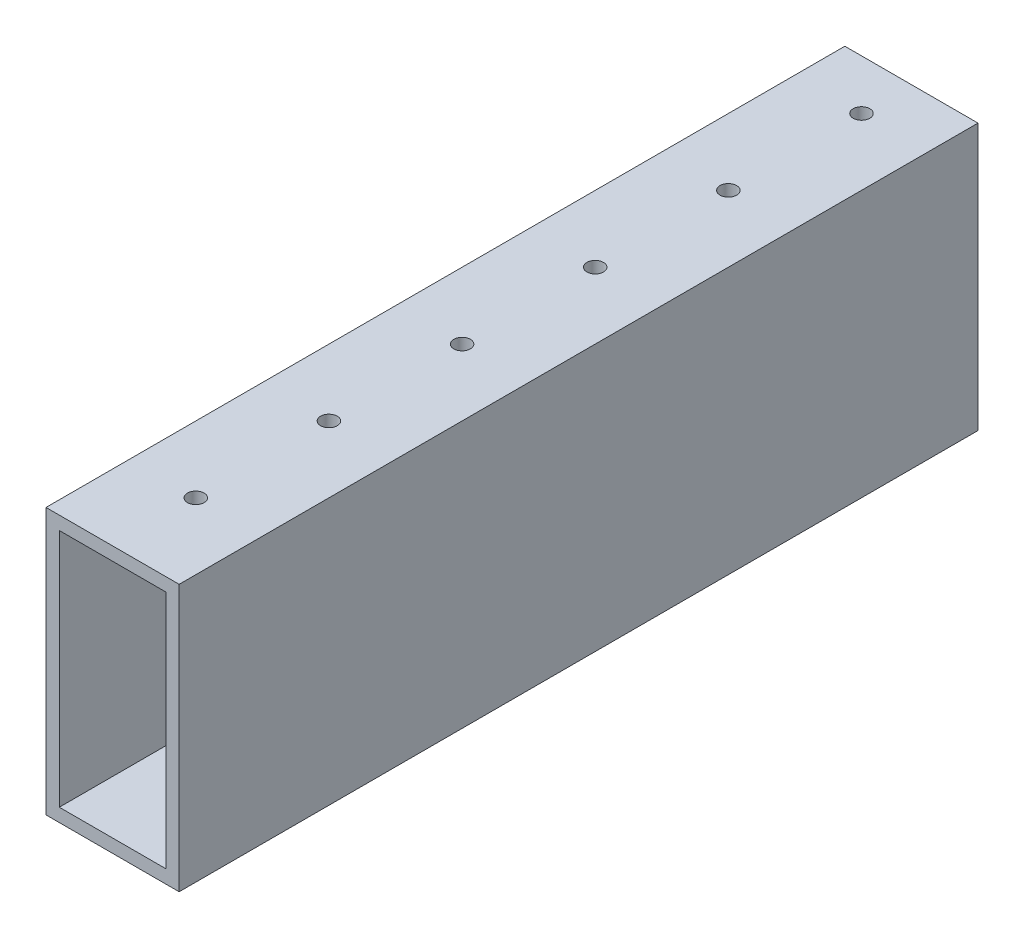
ISO-10303-21;
HEADER;
FILE_DESCRIPTION(('STEP AP214'),'2;1');
FILE_NAME('part.step','',(''),(''),'','','');
FILE_SCHEMA(('AUTOMOTIVE_DESIGN { 1 0 10303 214 1 1 1 1 }'));
ENDSEC;
DATA;
#1=APPLICATION_CONTEXT('core data for automotive mechanical design processes');
#2=APPLICATION_PROTOCOL_DEFINITION('international standard','automotive_design',2000,#1);
#3=PRODUCT_CONTEXT('',#1,'mechanical');
#4=PRODUCT('Part','Part','',(#3));
#5=PRODUCT_RELATED_PRODUCT_CATEGORY('part','',(#4));
#6=PRODUCT_DEFINITION_FORMATION('','',#4);
#7=PRODUCT_DEFINITION_CONTEXT('part definition',#1,'design');
#8=PRODUCT_DEFINITION('design','',#6,#7);
#9=PRODUCT_DEFINITION_SHAPE('','',#8);
#10=(LENGTH_UNIT() NAMED_UNIT(*) SI_UNIT(.MILLI.,.METRE.));
#11=(NAMED_UNIT(*) PLANE_ANGLE_UNIT() SI_UNIT($,.RADIAN.));
#12=(NAMED_UNIT(*) SI_UNIT($,.STERADIAN.) SOLID_ANGLE_UNIT());
#13=UNCERTAINTY_MEASURE_WITH_UNIT(LENGTH_MEASURE(1.E-05),#10,'distance_accuracy_value','');
#14=(GEOMETRIC_REPRESENTATION_CONTEXT(3) GLOBAL_UNCERTAINTY_ASSIGNED_CONTEXT((#13)) GLOBAL_UNIT_ASSIGNED_CONTEXT((#10,
#11,#12)) REPRESENTATION_CONTEXT('',''));
#15=CARTESIAN_POINT('',(0.,0.,0.));
#16=DIRECTION('',(0.,0.,1.));
#17=DIRECTION('',(1.,0.,0.));
#18=AXIS2_PLACEMENT_3D('',#15,#16,#17);
#19=CARTESIAN_POINT('',(0.,0.,152.4));
#20=DIRECTION('',(0.,0.,1.));
#21=DIRECTION('',(1.,0.,0.));
#22=AXIS2_PLACEMENT_3D('',#19,#20,#21);
#23=PLANE('',#22);
#24=DIRECTION('',(0.,-1.,0.));
#25=VECTOR('',#24,1.);
#26=CARTESIAN_POINT('',(0.,0.,152.4));
#27=LINE('',#26,#25);
#28=CARTESIAN_POINT('',(0.,50.8,152.4));
#29=VERTEX_POINT('',#28);
#30=CARTESIAN_POINT('',(0.,0.,152.4));
#31=VERTEX_POINT('',#30);
#32=EDGE_CURVE('E163',#29,#31,#27,.T.);
#33=ORIENTED_EDGE('',*,*,#32,.T.);
#34=DIRECTION('',(1.,0.,0.));
#35=VECTOR('',#34,1.);
#36=CARTESIAN_POINT('',(0.,0.,152.4));
#37=LINE('',#36,#35);
#38=CARTESIAN_POINT('',(25.4,0.,152.4));
#39=VERTEX_POINT('',#38);
#40=EDGE_CURVE('E166',#31,#39,#37,.T.);
#41=ORIENTED_EDGE('',*,*,#40,.T.);
#42=DIRECTION('',(0.,1.,0.));
#43=VECTOR('',#42,1.);
#44=CARTESIAN_POINT('',(25.4,0.,152.4));
#45=LINE('',#44,#43);
#46=CARTESIAN_POINT('',(25.4,50.8,152.4));
#47=VERTEX_POINT('',#46);
#48=EDGE_CURVE('E169',#39,#47,#45,.T.);
#49=ORIENTED_EDGE('',*,*,#48,.T.);
#50=DIRECTION('',(-1.,0.,0.));
#51=VECTOR('',#50,1.);
#52=CARTESIAN_POINT('',(0.,50.8,152.4));
#53=LINE('',#52,#51);
#54=EDGE_CURVE('E171',#47,#29,#53,.T.);
#55=ORIENTED_EDGE('',*,*,#54,.T.);
#56=EDGE_LOOP('',(#33,#41,#49,#55));
#57=FACE_BOUND('',#56,.T.);
#58=DIRECTION('',(1.,0.,0.));
#59=VECTOR('',#58,1.);
#60=CARTESIAN_POINT('',(0.,2.54,152.4));
#61=LINE('',#60,#59);
#62=CARTESIAN_POINT('',(2.54,2.54,152.4));
#63=VERTEX_POINT('',#62);
#64=CARTESIAN_POINT('',(22.86,2.54,152.4));
#65=VERTEX_POINT('',#64);
#66=EDGE_CURVE('E133',#63,#65,#61,.T.);
#67=ORIENTED_EDGE('',*,*,#66,.F.);
#68=DIRECTION('',(0.,-1.,0.));
#69=VECTOR('',#68,1.);
#70=CARTESIAN_POINT('',(2.54,0.,152.4));
#71=LINE('',#70,#69);
#72=CARTESIAN_POINT('',(2.54,48.26,152.4));
#73=VERTEX_POINT('',#72);
#74=EDGE_CURVE('E125',#73,#63,#71,.T.);
#75=ORIENTED_EDGE('',*,*,#74,.F.);
#76=DIRECTION('',(-1.,0.,0.));
#77=VECTOR('',#76,1.);
#78=CARTESIAN_POINT('',(0.,48.26,152.4));
#79=LINE('',#78,#77);
#80=CARTESIAN_POINT('',(22.86,48.26,152.4));
#81=VERTEX_POINT('',#80);
#82=EDGE_CURVE('E147',#81,#73,#79,.T.);
#83=ORIENTED_EDGE('',*,*,#82,.F.);
#84=DIRECTION('',(0.,1.,0.));
#85=VECTOR('',#84,1.);
#86=CARTESIAN_POINT('',(22.86,0.,152.4));
#87=LINE('',#86,#85);
#88=EDGE_CURVE('E145',#65,#81,#87,.T.);
#89=ORIENTED_EDGE('',*,*,#88,.F.);
#90=EDGE_LOOP('',(#67,#75,#83,#89));
#91=FACE_BOUND('',#90,.T.);
#92=ADVANCED_FACE('F58',(#57,#91),#23,.T.);
#93=CARTESIAN_POINT('',(0.,0.,0.));
#94=DIRECTION('',(0.,0.,1.));
#95=DIRECTION('',(1.,0.,0.));
#96=AXIS2_PLACEMENT_3D('',#93,#94,#95);
#97=PLANE('',#96);
#98=DIRECTION('',(0.,-1.,0.));
#99=VECTOR('',#98,1.);
#100=CARTESIAN_POINT('',(0.,0.,0.));
#101=LINE('',#100,#99);
#102=CARTESIAN_POINT('',(0.,50.8,0.));
#103=VERTEX_POINT('',#102);
#104=CARTESIAN_POINT('',(0.,0.,0.));
#105=VERTEX_POINT('',#104);
#106=EDGE_CURVE('E141',#103,#105,#101,.T.);
#107=ORIENTED_EDGE('',*,*,#106,.F.);
#108=DIRECTION('',(-1.,0.,0.));
#109=VECTOR('',#108,1.);
#110=CARTESIAN_POINT('',(0.,50.8,0.));
#111=LINE('',#110,#109);
#112=CARTESIAN_POINT('',(25.4,50.8,0.));
#113=VERTEX_POINT('',#112);
#114=EDGE_CURVE('E167',#113,#103,#111,.T.);
#115=ORIENTED_EDGE('',*,*,#114,.F.);
#116=DIRECTION('',(0.,1.,0.));
#117=VECTOR('',#116,1.);
#118=CARTESIAN_POINT('',(25.4,0.,0.));
#119=LINE('',#118,#117);
#120=CARTESIAN_POINT('',(25.4,0.,0.));
#121=VERTEX_POINT('',#120);
#122=EDGE_CURVE('E178',#121,#113,#119,.T.);
#123=ORIENTED_EDGE('',*,*,#122,.F.);
#124=DIRECTION('',(1.,0.,0.));
#125=VECTOR('',#124,1.);
#126=CARTESIAN_POINT('',(0.,0.,0.));
#127=LINE('',#126,#125);
#128=EDGE_CURVE('E176',#105,#121,#127,.T.);
#129=ORIENTED_EDGE('',*,*,#128,.F.);
#130=EDGE_LOOP('',(#107,#115,#123,#129));
#131=FACE_BOUND('',#130,.T.);
#132=DIRECTION('',(0.,-1.,0.));
#133=VECTOR('',#132,1.);
#134=CARTESIAN_POINT('',(2.54,0.,0.));
#135=LINE('',#134,#133);
#136=CARTESIAN_POINT('',(2.54,48.26,0.));
#137=VERTEX_POINT('',#136);
#138=CARTESIAN_POINT('',(2.54,2.54,0.));
#139=VERTEX_POINT('',#138);
#140=EDGE_CURVE('E83',#137,#139,#135,.T.);
#141=ORIENTED_EDGE('',*,*,#140,.T.);
#142=DIRECTION('',(1.,0.,0.));
#143=VECTOR('',#142,1.);
#144=CARTESIAN_POINT('',(0.,2.54,0.));
#145=LINE('',#144,#143);
#146=CARTESIAN_POINT('',(22.86,2.54,0.));
#147=VERTEX_POINT('',#146);
#148=EDGE_CURVE('E140',#139,#147,#145,.T.);
#149=ORIENTED_EDGE('',*,*,#148,.T.);
#150=DIRECTION('',(0.,1.,0.));
#151=VECTOR('',#150,1.);
#152=CARTESIAN_POINT('',(22.86,0.,0.));
#153=LINE('',#152,#151);
#154=CARTESIAN_POINT('',(22.86,48.26,0.));
#155=VERTEX_POINT('',#154);
#156=EDGE_CURVE('E155',#147,#155,#153,.T.);
#157=ORIENTED_EDGE('',*,*,#156,.T.);
#158=DIRECTION('',(-1.,0.,0.));
#159=VECTOR('',#158,1.);
#160=CARTESIAN_POINT('',(0.,48.26,0.));
#161=LINE('',#160,#159);
#162=EDGE_CURVE('E134',#155,#137,#161,.T.);
#163=ORIENTED_EDGE('',*,*,#162,.T.);
#164=EDGE_LOOP('',(#141,#149,#157,#163));
#165=FACE_BOUND('',#164,.T.);
#166=ADVANCED_FACE('F247',(#131,#165),#97,.F.);
#167=CARTESIAN_POINT('',(0.,0.,152.4));
#168=DIRECTION('',(1.,0.,0.));
#169=DIRECTION('',(0.,0.,-1.));
#170=AXIS2_PLACEMENT_3D('',#167,#168,#169);
#171=PLANE('',#170);
#172=ORIENTED_EDGE('',*,*,#106,.T.);
#173=DIRECTION('',(0.,0.,-1.));
#174=VECTOR('',#173,1.);
#175=CARTESIAN_POINT('',(0.,0.,152.4));
#176=LINE('',#175,#174);
#177=EDGE_CURVE('E12',#31,#105,#176,.T.);
#178=ORIENTED_EDGE('',*,*,#177,.F.);
#179=ORIENTED_EDGE('',*,*,#32,.F.);
#180=DIRECTION('',(0.,0.,-1.));
#181=VECTOR('',#180,1.);
#182=CARTESIAN_POINT('',(0.,50.8,152.4));
#183=LINE('',#182,#181);
#184=EDGE_CURVE('E173',#29,#103,#183,.T.);
#185=ORIENTED_EDGE('',*,*,#184,.T.);
#186=EDGE_LOOP('',(#172,#178,#179,#185));
#187=FACE_BOUND('',#186,.T.);
#188=ADVANCED_FACE('F60',(#187),#171,.F.);
#189=CARTESIAN_POINT('',(0.,0.,152.4));
#190=DIRECTION('',(0.,1.,0.));
#191=DIRECTION('',(0.,0.,1.));
#192=AXIS2_PLACEMENT_3D('',#189,#190,#191);
#193=PLANE('',#192);
#194=CARTESIAN_POINT('',(12.7,0.,111.125));
#195=DIRECTION('',(0.,1.,0.));
#196=DIRECTION('',(0.,0.,1.));
#197=AXIS2_PLACEMENT_3D('',#194,#195,#196);
#198=CIRCLE('',#197,1.58750000000011);
#199=CARTESIAN_POINT('',(12.7,0.,112.7125));
#200=VERTEX_POINT('',#199);
#201=EDGE_CURVE('E196',#200,#200,#198,.T.);
#202=ORIENTED_EDGE('',*,*,#201,.T.);
#203=EDGE_LOOP('',(#202));
#204=FACE_BOUND('',#203,.T.);
#205=CARTESIAN_POINT('',(12.7,0.,85.725));
#206=DIRECTION('',(0.,1.,0.));
#207=DIRECTION('',(0.,0.,1.));
#208=AXIS2_PLACEMENT_3D('',#205,#206,#207);
#209=CIRCLE('',#208,1.58750000000011);
#210=CARTESIAN_POINT('',(12.7,0.,87.3125000000001));
#211=VERTEX_POINT('',#210);
#212=EDGE_CURVE('E275',#211,#211,#209,.T.);
#213=ORIENTED_EDGE('',*,*,#212,.T.);
#214=EDGE_LOOP('',(#213));
#215=FACE_BOUND('',#214,.T.);
#216=CARTESIAN_POINT('',(12.7,0.,60.325));
#217=DIRECTION('',(0.,1.,0.));
#218=DIRECTION('',(0.,0.,1.));
#219=AXIS2_PLACEMENT_3D('',#216,#217,#218);
#220=CIRCLE('',#219,1.58750000000011);
#221=CARTESIAN_POINT('',(12.7,0.,61.9125000000001));
#222=VERTEX_POINT('',#221);
#223=EDGE_CURVE('E279',#222,#222,#220,.T.);
#224=ORIENTED_EDGE('',*,*,#223,.T.);
#225=EDGE_LOOP('',(#224));
#226=FACE_BOUND('',#225,.T.);
#227=CARTESIAN_POINT('',(12.7,0.,34.925));
#228=DIRECTION('',(0.,1.,0.));
#229=DIRECTION('',(0.,0.,1.));
#230=AXIS2_PLACEMENT_3D('',#227,#228,#229);
#231=CIRCLE('',#230,1.58750000000011);
#232=CARTESIAN_POINT('',(12.7,0.,36.5125000000001));
#233=VERTEX_POINT('',#232);
#234=EDGE_CURVE('E283',#233,#233,#231,.T.);
#235=ORIENTED_EDGE('',*,*,#234,.T.);
#236=EDGE_LOOP('',(#235));
#237=FACE_BOUND('',#236,.T.);
#238=CARTESIAN_POINT('',(12.7,0.,9.52500000000001));
#239=DIRECTION('',(0.,1.,0.));
#240=DIRECTION('',(0.,0.,1.));
#241=AXIS2_PLACEMENT_3D('',#238,#239,#240);
#242=CIRCLE('',#241,1.58750000000011);
#243=CARTESIAN_POINT('',(12.7,0.,11.1125000000001));
#244=VERTEX_POINT('',#243);
#245=EDGE_CURVE('E287',#244,#244,#242,.T.);
#246=ORIENTED_EDGE('',*,*,#245,.T.);
#247=EDGE_LOOP('',(#246));
#248=FACE_BOUND('',#247,.T.);
#249=CARTESIAN_POINT('',(12.7,0.,136.525));
#250=DIRECTION('',(0.,1.,0.));
#251=DIRECTION('',(0.,0.,1.));
#252=AXIS2_PLACEMENT_3D('',#249,#250,#251);
#253=CIRCLE('',#252,1.58750000000011);
#254=CARTESIAN_POINT('',(12.7,0.,138.1125));
#255=VERTEX_POINT('',#254);
#256=EDGE_CURVE('E191',#255,#255,#253,.T.);
#257=ORIENTED_EDGE('',*,*,#256,.T.);
#258=EDGE_LOOP('',(#257));
#259=FACE_BOUND('',#258,.T.);
#260=ORIENTED_EDGE('',*,*,#128,.T.);
#261=DIRECTION('',(0.,0.,-1.));
#262=VECTOR('',#261,1.);
#263=CARTESIAN_POINT('',(25.4,0.,152.4));
#264=LINE('',#263,#262);
#265=EDGE_CURVE('E67',#39,#121,#264,.T.);
#266=ORIENTED_EDGE('',*,*,#265,.F.);
#267=ORIENTED_EDGE('',*,*,#40,.F.);
#268=ORIENTED_EDGE('',*,*,#177,.T.);
#269=EDGE_LOOP('',(#260,#266,#267,#268));
#270=FACE_BOUND('',#269,.T.);
#271=ADVANCED_FACE('F261',(#204,#215,#226,#237,#248,#259,#270),#193,.F.);
#272=CARTESIAN_POINT('',(25.4,0.,152.4));
#273=DIRECTION('',(-1.,0.,0.));
#274=DIRECTION('',(0.,0.,1.));
#275=AXIS2_PLACEMENT_3D('',#272,#273,#274);
#276=PLANE('',#275);
#277=ORIENTED_EDGE('',*,*,#122,.T.);
#278=DIRECTION('',(0.,0.,-1.));
#279=VECTOR('',#278,1.);
#280=CARTESIAN_POINT('',(25.4,50.8,152.4));
#281=LINE('',#280,#279);
#282=EDGE_CURVE('E183',#47,#113,#281,.T.);
#283=ORIENTED_EDGE('',*,*,#282,.F.);
#284=ORIENTED_EDGE('',*,*,#48,.F.);
#285=ORIENTED_EDGE('',*,*,#265,.T.);
#286=EDGE_LOOP('',(#277,#283,#284,#285));
#287=FACE_BOUND('',#286,.T.);
#288=ADVANCED_FACE('F258',(#287),#276,.F.);
#289=CARTESIAN_POINT('',(0.,50.8,152.4));
#290=DIRECTION('',(0.,-1.,0.));
#291=DIRECTION('',(0.,0.,-1.));
#292=AXIS2_PLACEMENT_3D('',#289,#290,#291);
#293=PLANE('',#292);
#294=CARTESIAN_POINT('',(12.7,50.8,111.125));
#295=DIRECTION('',(0.,1.,0.));
#296=DIRECTION('',(0.,0.,1.));
#297=AXIS2_PLACEMENT_3D('',#294,#295,#296);
#298=CIRCLE('',#297,1.58750000000011);
#299=CARTESIAN_POINT('',(12.7,50.8,112.7125));
#300=VERTEX_POINT('',#299);
#301=EDGE_CURVE('E351',#300,#300,#298,.T.);
#302=ORIENTED_EDGE('',*,*,#301,.F.);
#303=EDGE_LOOP('',(#302));
#304=FACE_BOUND('',#303,.T.);
#305=CARTESIAN_POINT('',(12.7,50.8,85.725));
#306=DIRECTION('',(0.,1.,0.));
#307=DIRECTION('',(0.,0.,1.));
#308=AXIS2_PLACEMENT_3D('',#305,#306,#307);
#309=CIRCLE('',#308,1.58750000000011);
#310=CARTESIAN_POINT('',(12.7,50.8,87.3125000000001));
#311=VERTEX_POINT('',#310);
#312=EDGE_CURVE('E357',#311,#311,#309,.T.);
#313=ORIENTED_EDGE('',*,*,#312,.F.);
#314=EDGE_LOOP('',(#313));
#315=FACE_BOUND('',#314,.T.);
#316=CARTESIAN_POINT('',(12.7,50.8,60.325));
#317=DIRECTION('',(0.,1.,0.));
#318=DIRECTION('',(0.,0.,1.));
#319=AXIS2_PLACEMENT_3D('',#316,#317,#318);
#320=CIRCLE('',#319,1.58750000000011);
#321=CARTESIAN_POINT('',(12.7,50.8,61.9125000000001));
#322=VERTEX_POINT('',#321);
#323=EDGE_CURVE('E361',#322,#322,#320,.T.);
#324=ORIENTED_EDGE('',*,*,#323,.F.);
#325=EDGE_LOOP('',(#324));
#326=FACE_BOUND('',#325,.T.);
#327=CARTESIAN_POINT('',(12.7,50.8,34.925));
#328=DIRECTION('',(0.,1.,0.));
#329=DIRECTION('',(0.,0.,1.));
#330=AXIS2_PLACEMENT_3D('',#327,#328,#329);
#331=CIRCLE('',#330,1.58750000000011);
#332=CARTESIAN_POINT('',(12.7,50.8,36.5125000000001));
#333=VERTEX_POINT('',#332);
#334=EDGE_CURVE('E365',#333,#333,#331,.T.);
#335=ORIENTED_EDGE('',*,*,#334,.F.);
#336=EDGE_LOOP('',(#335));
#337=FACE_BOUND('',#336,.T.);
#338=CARTESIAN_POINT('',(12.7,50.8,9.52500000000001));
#339=DIRECTION('',(0.,1.,0.));
#340=DIRECTION('',(0.,0.,1.));
#341=AXIS2_PLACEMENT_3D('',#338,#339,#340);
#342=CIRCLE('',#341,1.58750000000011);
#343=CARTESIAN_POINT('',(12.7,50.8,11.1125000000001));
#344=VERTEX_POINT('',#343);
#345=EDGE_CURVE('E369',#344,#344,#342,.T.);
#346=ORIENTED_EDGE('',*,*,#345,.F.);
#347=EDGE_LOOP('',(#346));
#348=FACE_BOUND('',#347,.T.);
#349=CARTESIAN_POINT('',(12.7,50.8,136.525));
#350=DIRECTION('',(0.,1.,0.));
#351=DIRECTION('',(0.,0.,1.));
#352=AXIS2_PLACEMENT_3D('',#349,#350,#351);
#353=CIRCLE('',#352,1.58750000000011);
#354=CARTESIAN_POINT('',(12.7,50.8,138.1125));
#355=VERTEX_POINT('',#354);
#356=EDGE_CURVE('E221',#355,#355,#353,.T.);
#357=ORIENTED_EDGE('',*,*,#356,.F.);
#358=EDGE_LOOP('',(#357));
#359=FACE_BOUND('',#358,.T.);
#360=ORIENTED_EDGE('',*,*,#114,.T.);
#361=ORIENTED_EDGE('',*,*,#184,.F.);
#362=ORIENTED_EDGE('',*,*,#54,.F.);
#363=ORIENTED_EDGE('',*,*,#282,.T.);
#364=EDGE_LOOP('',(#360,#361,#362,#363));
#365=FACE_BOUND('',#364,.T.);
#366=ADVANCED_FACE('F242',(#304,#315,#326,#337,#348,#359,#365),#293,.F.);
#367=CARTESIAN_POINT('',(2.54,0.,152.4));
#368=DIRECTION('',(1.,0.,0.));
#369=DIRECTION('',(0.,0.,-1.));
#370=AXIS2_PLACEMENT_3D('',#367,#368,#369);
#371=PLANE('',#370);
#372=ORIENTED_EDGE('',*,*,#140,.F.);
#373=DIRECTION('',(0.,0.,-1.));
#374=VECTOR('',#373,1.);
#375=CARTESIAN_POINT('',(2.54,48.26,152.4));
#376=LINE('',#375,#374);
#377=EDGE_CURVE('E129',#73,#137,#376,.T.);
#378=ORIENTED_EDGE('',*,*,#377,.F.);
#379=ORIENTED_EDGE('',*,*,#74,.T.);
#380=DIRECTION('',(0.,0.,-1.));
#381=VECTOR('',#380,1.);
#382=CARTESIAN_POINT('',(2.54,2.54,152.4));
#383=LINE('',#382,#381);
#384=EDGE_CURVE('E128',#63,#139,#383,.T.);
#385=ORIENTED_EDGE('',*,*,#384,.T.);
#386=EDGE_LOOP('',(#372,#378,#379,#385));
#387=FACE_BOUND('',#386,.T.);
#388=ADVANCED_FACE('F127',(#387),#371,.T.);
#389=CARTESIAN_POINT('',(0.,2.54,152.4));
#390=DIRECTION('',(0.,1.,0.));
#391=DIRECTION('',(0.,0.,1.));
#392=AXIS2_PLACEMENT_3D('',#389,#390,#391);
#393=PLANE('',#392);
#394=CARTESIAN_POINT('',(12.7,2.54,111.125));
#395=DIRECTION('',(0.,1.,0.));
#396=DIRECTION('',(0.,0.,1.));
#397=AXIS2_PLACEMENT_3D('',#394,#395,#396);
#398=CIRCLE('',#397,1.58750000000011);
#399=CARTESIAN_POINT('',(12.7,2.54,112.7125));
#400=VERTEX_POINT('',#399);
#401=EDGE_CURVE('E218',#400,#400,#398,.T.);
#402=ORIENTED_EDGE('',*,*,#401,.F.);
#403=EDGE_LOOP('',(#402));
#404=FACE_BOUND('',#403,.T.);
#405=CARTESIAN_POINT('',(12.7,2.54,85.725));
#406=DIRECTION('',(0.,1.,0.));
#407=DIRECTION('',(0.,0.,1.));
#408=AXIS2_PLACEMENT_3D('',#405,#406,#407);
#409=CIRCLE('',#408,1.58750000000011);
#410=CARTESIAN_POINT('',(12.7,2.54,87.3125000000001));
#411=VERTEX_POINT('',#410);
#412=EDGE_CURVE('E206',#411,#411,#409,.T.);
#413=ORIENTED_EDGE('',*,*,#412,.F.);
#414=EDGE_LOOP('',(#413));
#415=FACE_BOUND('',#414,.T.);
#416=CARTESIAN_POINT('',(12.7,2.54,60.325));
#417=DIRECTION('',(0.,1.,0.));
#418=DIRECTION('',(0.,0.,1.));
#419=AXIS2_PLACEMENT_3D('',#416,#417,#418);
#420=CIRCLE('',#419,1.58750000000011);
#421=CARTESIAN_POINT('',(12.7,2.54,61.9125000000001));
#422=VERTEX_POINT('',#421);
#423=EDGE_CURVE('E203',#422,#422,#420,.T.);
#424=ORIENTED_EDGE('',*,*,#423,.F.);
#425=EDGE_LOOP('',(#424));
#426=FACE_BOUND('',#425,.T.);
#427=CARTESIAN_POINT('',(12.7,2.54,34.925));
#428=DIRECTION('',(0.,1.,0.));
#429=DIRECTION('',(0.,0.,1.));
#430=AXIS2_PLACEMENT_3D('',#427,#428,#429);
#431=CIRCLE('',#430,1.58750000000011);
#432=CARTESIAN_POINT('',(12.7,2.54,36.5125000000001));
#433=VERTEX_POINT('',#432);
#434=EDGE_CURVE('E200',#433,#433,#431,.T.);
#435=ORIENTED_EDGE('',*,*,#434,.F.);
#436=EDGE_LOOP('',(#435));
#437=FACE_BOUND('',#436,.T.);
#438=CARTESIAN_POINT('',(12.7,2.54,9.52500000000001));
#439=DIRECTION('',(0.,1.,0.));
#440=DIRECTION('',(0.,0.,1.));
#441=AXIS2_PLACEMENT_3D('',#438,#439,#440);
#442=CIRCLE('',#441,1.58750000000011);
#443=CARTESIAN_POINT('',(12.7,2.54,11.1125000000001));
#444=VERTEX_POINT('',#443);
#445=EDGE_CURVE('E195',#444,#444,#442,.T.);
#446=ORIENTED_EDGE('',*,*,#445,.F.);
#447=EDGE_LOOP('',(#446));
#448=FACE_BOUND('',#447,.T.);
#449=CARTESIAN_POINT('',(12.7,2.54,136.525));
#450=DIRECTION('',(0.,1.,0.));
#451=DIRECTION('',(0.,0.,1.));
#452=AXIS2_PLACEMENT_3D('',#449,#450,#451);
#453=CIRCLE('',#452,1.58750000000011);
#454=CARTESIAN_POINT('',(12.7,2.54,138.1125));
#455=VERTEX_POINT('',#454);
#456=EDGE_CURVE('E153',#455,#455,#453,.T.);
#457=ORIENTED_EDGE('',*,*,#456,.F.);
#458=EDGE_LOOP('',(#457));
#459=FACE_BOUND('',#458,.T.);
#460=ORIENTED_EDGE('',*,*,#148,.F.);
#461=ORIENTED_EDGE('',*,*,#384,.F.);
#462=ORIENTED_EDGE('',*,*,#66,.T.);
#463=DIRECTION('',(0.,0.,-1.));
#464=VECTOR('',#463,1.);
#465=CARTESIAN_POINT('',(22.86,2.54,152.4));
#466=LINE('',#465,#464);
#467=EDGE_CURVE('E142',#65,#147,#466,.T.);
#468=ORIENTED_EDGE('',*,*,#467,.T.);
#469=EDGE_LOOP('',(#460,#461,#462,#468));
#470=FACE_BOUND('',#469,.T.);
#471=ADVANCED_FACE('F137',(#404,#415,#426,#437,#448,#459,#470),#393,.T.);
#472=CARTESIAN_POINT('',(22.86,0.,152.4));
#473=DIRECTION('',(-1.,0.,0.));
#474=DIRECTION('',(0.,0.,1.));
#475=AXIS2_PLACEMENT_3D('',#472,#473,#474);
#476=PLANE('',#475);
#477=ORIENTED_EDGE('',*,*,#156,.F.);
#478=ORIENTED_EDGE('',*,*,#467,.F.);
#479=ORIENTED_EDGE('',*,*,#88,.T.);
#480=DIRECTION('',(0.,0.,-1.));
#481=VECTOR('',#480,1.);
#482=CARTESIAN_POINT('',(22.86,48.26,152.4));
#483=LINE('',#482,#481);
#484=EDGE_CURVE('E75',#81,#155,#483,.T.);
#485=ORIENTED_EDGE('',*,*,#484,.T.);
#486=EDGE_LOOP('',(#477,#478,#479,#485));
#487=FACE_BOUND('',#486,.T.);
#488=ADVANCED_FACE('F232',(#487),#476,.T.);
#489=CARTESIAN_POINT('',(0.,48.26,152.4));
#490=DIRECTION('',(0.,-1.,0.));
#491=DIRECTION('',(0.,0.,-1.));
#492=AXIS2_PLACEMENT_3D('',#489,#490,#491);
#493=PLANE('',#492);
#494=CARTESIAN_POINT('',(12.7,48.26,111.125));
#495=DIRECTION('',(0.,-1.,0.));
#496=DIRECTION('',(0.,0.,-1.));
#497=AXIS2_PLACEMENT_3D('',#494,#495,#496);
#498=CIRCLE('',#497,1.58750000000011);
#499=CARTESIAN_POINT('',(12.7,48.26,109.5375));
#500=VERTEX_POINT('',#499);
#501=EDGE_CURVE('E62',#500,#500,#498,.T.);
#502=ORIENTED_EDGE('',*,*,#501,.F.);
#503=EDGE_LOOP('',(#502));
#504=FACE_BOUND('',#503,.T.);
#505=CARTESIAN_POINT('',(12.7,48.26,85.725));
#506=DIRECTION('',(0.,-1.,0.));
#507=DIRECTION('',(0.,0.,-1.));
#508=AXIS2_PLACEMENT_3D('',#505,#506,#507);
#509=CIRCLE('',#508,1.58750000000011);
#510=CARTESIAN_POINT('',(12.7,48.26,84.1374999999999));
#511=VERTEX_POINT('',#510);
#512=EDGE_CURVE('E204',#511,#511,#509,.T.);
#513=ORIENTED_EDGE('',*,*,#512,.F.);
#514=EDGE_LOOP('',(#513));
#515=FACE_BOUND('',#514,.T.);
#516=CARTESIAN_POINT('',(12.7,48.26,60.325));
#517=DIRECTION('',(0.,-1.,0.));
#518=DIRECTION('',(0.,0.,-1.));
#519=AXIS2_PLACEMENT_3D('',#516,#517,#518);
#520=CIRCLE('',#519,1.58750000000011);
#521=CARTESIAN_POINT('',(12.7,48.26,58.7374999999999));
#522=VERTEX_POINT('',#521);
#523=EDGE_CURVE('E201',#522,#522,#520,.T.);
#524=ORIENTED_EDGE('',*,*,#523,.F.);
#525=EDGE_LOOP('',(#524));
#526=FACE_BOUND('',#525,.T.);
#527=CARTESIAN_POINT('',(12.7,48.26,34.925));
#528=DIRECTION('',(0.,-1.,0.));
#529=DIRECTION('',(0.,0.,-1.));
#530=AXIS2_PLACEMENT_3D('',#527,#528,#529);
#531=CIRCLE('',#530,1.58750000000011);
#532=CARTESIAN_POINT('',(12.7,48.26,33.3374999999999));
#533=VERTEX_POINT('',#532);
#534=EDGE_CURVE('E197',#533,#533,#531,.T.);
#535=ORIENTED_EDGE('',*,*,#534,.F.);
#536=EDGE_LOOP('',(#535));
#537=FACE_BOUND('',#536,.T.);
#538=CARTESIAN_POINT('',(12.7,48.26,9.52500000000001));
#539=DIRECTION('',(0.,-1.,0.));
#540=DIRECTION('',(0.,0.,-1.));
#541=AXIS2_PLACEMENT_3D('',#538,#539,#540);
#542=CIRCLE('',#541,1.58750000000011);
#543=CARTESIAN_POINT('',(12.7,48.26,7.93749999999989));
#544=VERTEX_POINT('',#543);
#545=EDGE_CURVE('E192',#544,#544,#542,.T.);
#546=ORIENTED_EDGE('',*,*,#545,.F.);
#547=EDGE_LOOP('',(#546));
#548=FACE_BOUND('',#547,.T.);
#549=CARTESIAN_POINT('',(12.7,48.26,136.525));
#550=DIRECTION('',(0.,-1.,0.));
#551=DIRECTION('',(0.,0.,-1.));
#552=AXIS2_PLACEMENT_3D('',#549,#550,#551);
#553=CIRCLE('',#552,1.58750000000011);
#554=CARTESIAN_POINT('',(12.7,48.26,134.9375));
#555=VERTEX_POINT('',#554);
#556=EDGE_CURVE('E188',#555,#555,#553,.T.);
#557=ORIENTED_EDGE('',*,*,#556,.F.);
#558=EDGE_LOOP('',(#557));
#559=FACE_BOUND('',#558,.T.);
#560=ORIENTED_EDGE('',*,*,#162,.F.);
#561=ORIENTED_EDGE('',*,*,#484,.F.);
#562=ORIENTED_EDGE('',*,*,#82,.T.);
#563=ORIENTED_EDGE('',*,*,#377,.T.);
#564=EDGE_LOOP('',(#560,#561,#562,#563));
#565=FACE_BOUND('',#564,.T.);
#566=ADVANCED_FACE('F239',(#504,#515,#526,#537,#548,#559,#565),#493,.T.);
#567=CARTESIAN_POINT('',(12.7,0.,136.525));
#568=DIRECTION('',(0.,1.,0.));
#569=DIRECTION('',(0.,0.,1.));
#570=AXIS2_PLACEMENT_3D('',#567,#568,#569);
#571=CYLINDRICAL_SURFACE('',#570,1.58750000000011);
#572=ORIENTED_EDGE('',*,*,#556,.T.);
#573=EDGE_LOOP('',(#572));
#574=FACE_BOUND('',#573,.T.);
#575=ORIENTED_EDGE('',*,*,#356,.T.);
#576=EDGE_LOOP('',(#575));
#577=FACE_BOUND('',#576,.T.);
#578=ADVANCED_FACE('F304',(#574,#577),#571,.F.);
#579=ORIENTED_EDGE('',*,*,#456,.T.);
#580=EDGE_LOOP('',(#579));
#581=FACE_BOUND('',#580,.T.);
#582=ORIENTED_EDGE('',*,*,#256,.F.);
#583=EDGE_LOOP('',(#582));
#584=FACE_BOUND('',#583,.T.);
#585=ADVANCED_FACE('F228',(#581,#584),#571,.F.);
#586=CARTESIAN_POINT('',(12.7,0.,9.52500000000001));
#587=DIRECTION('',(0.,1.,0.));
#588=DIRECTION('',(0.,0.,1.));
#589=AXIS2_PLACEMENT_3D('',#586,#587,#588);
#590=CYLINDRICAL_SURFACE('',#589,1.58750000000011);
#591=ORIENTED_EDGE('',*,*,#545,.T.);
#592=EDGE_LOOP('',(#591));
#593=FACE_BOUND('',#592,.T.);
#594=ORIENTED_EDGE('',*,*,#345,.T.);
#595=EDGE_LOOP('',(#594));
#596=FACE_BOUND('',#595,.T.);
#597=ADVANCED_FACE('F315',(#593,#596),#590,.F.);
#598=CARTESIAN_POINT('',(12.7,0.,34.925));
#599=DIRECTION('',(0.,1.,0.));
#600=DIRECTION('',(0.,0.,1.));
#601=AXIS2_PLACEMENT_3D('',#598,#599,#600);
#602=CYLINDRICAL_SURFACE('',#601,1.58750000000011);
#603=ORIENTED_EDGE('',*,*,#534,.T.);
#604=EDGE_LOOP('',(#603));
#605=FACE_BOUND('',#604,.T.);
#606=ORIENTED_EDGE('',*,*,#334,.T.);
#607=EDGE_LOOP('',(#606));
#608=FACE_BOUND('',#607,.T.);
#609=ADVANCED_FACE('F318',(#605,#608),#602,.F.);
#610=CARTESIAN_POINT('',(12.7,0.,60.325));
#611=DIRECTION('',(0.,1.,0.));
#612=DIRECTION('',(0.,0.,1.));
#613=AXIS2_PLACEMENT_3D('',#610,#611,#612);
#614=CYLINDRICAL_SURFACE('',#613,1.58750000000011);
#615=ORIENTED_EDGE('',*,*,#523,.T.);
#616=EDGE_LOOP('',(#615));
#617=FACE_BOUND('',#616,.T.);
#618=ORIENTED_EDGE('',*,*,#323,.T.);
#619=EDGE_LOOP('',(#618));
#620=FACE_BOUND('',#619,.T.);
#621=ADVANCED_FACE('F323',(#617,#620),#614,.F.);
#622=CARTESIAN_POINT('',(12.7,0.,85.725));
#623=DIRECTION('',(0.,1.,0.));
#624=DIRECTION('',(0.,0.,1.));
#625=AXIS2_PLACEMENT_3D('',#622,#623,#624);
#626=CYLINDRICAL_SURFACE('',#625,1.58750000000011);
#627=ORIENTED_EDGE('',*,*,#512,.T.);
#628=EDGE_LOOP('',(#627));
#629=FACE_BOUND('',#628,.T.);
#630=ORIENTED_EDGE('',*,*,#312,.T.);
#631=EDGE_LOOP('',(#630));
#632=FACE_BOUND('',#631,.T.);
#633=ADVANCED_FACE('F328',(#629,#632),#626,.F.);
#634=CARTESIAN_POINT('',(12.7,0.,111.125));
#635=DIRECTION('',(0.,1.,0.));
#636=DIRECTION('',(0.,0.,1.));
#637=AXIS2_PLACEMENT_3D('',#634,#635,#636);
#638=CYLINDRICAL_SURFACE('',#637,1.58750000000011);
#639=ORIENTED_EDGE('',*,*,#501,.T.);
#640=EDGE_LOOP('',(#639));
#641=FACE_BOUND('',#640,.T.);
#642=ORIENTED_EDGE('',*,*,#301,.T.);
#643=EDGE_LOOP('',(#642));
#644=FACE_BOUND('',#643,.T.);
#645=ADVANCED_FACE('F333',(#641,#644),#638,.F.);
#646=ORIENTED_EDGE('',*,*,#445,.T.);
#647=EDGE_LOOP('',(#646));
#648=FACE_BOUND('',#647,.T.);
#649=ORIENTED_EDGE('',*,*,#245,.F.);
#650=EDGE_LOOP('',(#649));
#651=FACE_BOUND('',#650,.T.);
#652=ADVANCED_FACE('F320',(#648,#651),#590,.F.);
#653=ORIENTED_EDGE('',*,*,#434,.T.);
#654=EDGE_LOOP('',(#653));
#655=FACE_BOUND('',#654,.T.);
#656=ORIENTED_EDGE('',*,*,#234,.F.);
#657=EDGE_LOOP('',(#656));
#658=FACE_BOUND('',#657,.T.);
#659=ADVANCED_FACE('F325',(#655,#658),#602,.F.);
#660=ORIENTED_EDGE('',*,*,#423,.T.);
#661=EDGE_LOOP('',(#660));
#662=FACE_BOUND('',#661,.T.);
#663=ORIENTED_EDGE('',*,*,#223,.F.);
#664=EDGE_LOOP('',(#663));
#665=FACE_BOUND('',#664,.T.);
#666=ADVANCED_FACE('F330',(#662,#665),#614,.F.);
#667=ORIENTED_EDGE('',*,*,#412,.T.);
#668=EDGE_LOOP('',(#667));
#669=FACE_BOUND('',#668,.T.);
#670=ORIENTED_EDGE('',*,*,#212,.F.);
#671=EDGE_LOOP('',(#670));
#672=FACE_BOUND('',#671,.T.);
#673=ADVANCED_FACE('F334',(#669,#672),#626,.F.);
#674=ORIENTED_EDGE('',*,*,#401,.T.);
#675=EDGE_LOOP('',(#674));
#676=FACE_BOUND('',#675,.T.);
#677=ORIENTED_EDGE('',*,*,#201,.F.);
#678=EDGE_LOOP('',(#677));
#679=FACE_BOUND('',#678,.T.);
#680=ADVANCED_FACE('F337',(#676,#679),#638,.F.);
#681=CLOSED_SHELL('',(#92,#166,#188,#271,#288,#366,#388,#471,#488,#566,#578,#585,#597,#609,#621,
#633,#645,#652,#659,#666,#673,#680));
#682=MANIFOLD_SOLID_BREP('B2',#681);
#683=ADVANCED_BREP_SHAPE_REPRESENTATION('',(#18,#682),#14);
#684=SHAPE_DEFINITION_REPRESENTATION(#9,#683);
ENDSEC;
END-ISO-10303-21;
